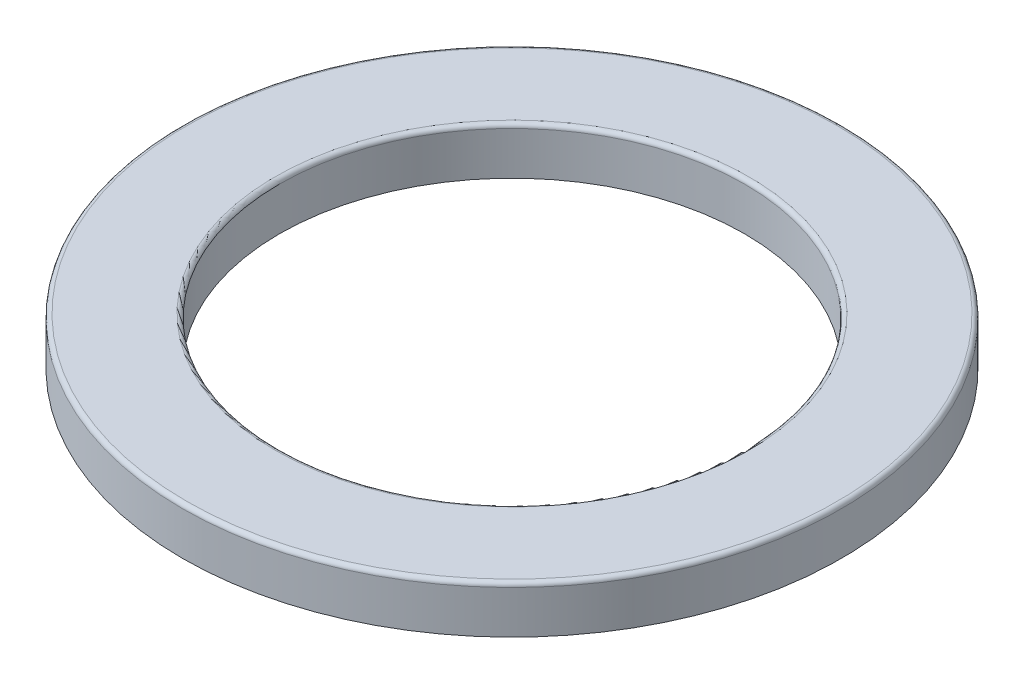
ISO-10303-21;
HEADER;
FILE_DESCRIPTION(('STEP AP214'),'2;1');
FILE_NAME('part.step','',(''),(''),'','','');
FILE_SCHEMA(('AUTOMOTIVE_DESIGN { 1 0 10303 214 1 1 1 1 }'));
ENDSEC;
DATA;
#1=APPLICATION_CONTEXT('core data for automotive mechanical design processes');
#2=APPLICATION_PROTOCOL_DEFINITION('international standard','automotive_design',2000,#1);
#3=PRODUCT_CONTEXT('',#1,'mechanical');
#4=PRODUCT('Part','Part','',(#3));
#5=PRODUCT_RELATED_PRODUCT_CATEGORY('part','',(#4));
#6=PRODUCT_DEFINITION_FORMATION('','',#4);
#7=PRODUCT_DEFINITION_CONTEXT('part definition',#1,'design');
#8=PRODUCT_DEFINITION('design','',#6,#7);
#9=PRODUCT_DEFINITION_SHAPE('','',#8);
#10=(LENGTH_UNIT() NAMED_UNIT(*) SI_UNIT(.MILLI.,.METRE.));
#11=(NAMED_UNIT(*) PLANE_ANGLE_UNIT() SI_UNIT($,.RADIAN.));
#12=(NAMED_UNIT(*) SI_UNIT($,.STERADIAN.) SOLID_ANGLE_UNIT());
#13=UNCERTAINTY_MEASURE_WITH_UNIT(LENGTH_MEASURE(1.E-05),#10,'distance_accuracy_value','');
#14=(GEOMETRIC_REPRESENTATION_CONTEXT(3) GLOBAL_UNCERTAINTY_ASSIGNED_CONTEXT((#13)) GLOBAL_UNIT_ASSIGNED_CONTEXT((#10,
#11,#12)) REPRESENTATION_CONTEXT('',''));
#15=CARTESIAN_POINT('',(0.,0.,0.));
#16=DIRECTION('',(0.,0.,1.));
#17=DIRECTION('',(1.,0.,0.));
#18=AXIS2_PLACEMENT_3D('',#15,#16,#17);
#19=CARTESIAN_POINT('',(0.,0.,0.));
#20=DIRECTION('',(0.,1.,0.));
#21=DIRECTION('',(0.,0.,1.));
#22=AXIS2_PLACEMENT_3D('',#19,#20,#21);
#23=PLANE('',#22);
#24=CARTESIAN_POINT('',(0.,0.,0.));
#25=DIRECTION('',(0.,1.,0.));
#26=DIRECTION('',(0.,0.,1.));
#27=AXIS2_PLACEMENT_3D('',#24,#25,#26);
#28=CIRCLE('',#27,85.);
#29=CARTESIAN_POINT('',(0.,0.,85.));
#30=VERTEX_POINT('',#29);
#31=EDGE_CURVE('E52',#30,#30,#28,.T.);
#32=ORIENTED_EDGE('',*,*,#31,.F.);
#33=EDGE_LOOP('',(#32));
#34=FACE_BOUND('',#33,.T.);
#35=CARTESIAN_POINT('',(0.,0.,0.));
#36=DIRECTION('',(0.,1.,0.));
#37=DIRECTION('',(0.,0.,1.));
#38=AXIS2_PLACEMENT_3D('',#35,#36,#37);
#39=CIRCLE('',#38,77.98);
#40=CARTESIAN_POINT('',(0.,0.,77.98));
#41=VERTEX_POINT('',#40);
#42=EDGE_CURVE('E61',#41,#41,#39,.T.);
#43=ORIENTED_EDGE('',*,*,#42,.T.);
#44=EDGE_LOOP('',(#43));
#45=FACE_BOUND('',#44,.T.);
#46=ADVANCED_FACE('F32',(#34,#45),#23,.F.);
#47=CARTESIAN_POINT('',(0.,0.,0.));
#48=DIRECTION('',(0.,1.,0.));
#49=DIRECTION('',(0.,0.,1.));
#50=AXIS2_PLACEMENT_3D('',#47,#48,#49);
#51=CIRCLE('',#50,60.);
#52=CARTESIAN_POINT('',(0.,0.,60.));
#53=VERTEX_POINT('',#52);
#54=EDGE_CURVE('E55',#53,#53,#51,.T.);
#55=ORIENTED_EDGE('',*,*,#54,.T.);
#56=EDGE_LOOP('',(#55));
#57=FACE_BOUND('',#56,.T.);
#58=CARTESIAN_POINT('',(0.,0.,0.));
#59=DIRECTION('',(0.,1.,0.));
#60=DIRECTION('',(0.,0.,1.));
#61=AXIS2_PLACEMENT_3D('',#58,#59,#60);
#62=CIRCLE('',#61,67.02);
#63=CARTESIAN_POINT('',(0.,0.,67.02));
#64=VERTEX_POINT('',#63);
#65=EDGE_CURVE('E58',#64,#64,#62,.T.);
#66=ORIENTED_EDGE('',*,*,#65,.F.);
#67=EDGE_LOOP('',(#66));
#68=FACE_BOUND('',#67,.T.);
#69=ADVANCED_FACE('F72',(#57,#68),#23,.F.);
#70=CARTESIAN_POINT('',(0.,12.2,0.));
#71=DIRECTION('',(0.,1.,0.));
#72=DIRECTION('',(0.,0.,1.));
#73=AXIS2_PLACEMENT_3D('',#70,#71,#72);
#74=PLANE('',#73);
#75=CARTESIAN_POINT('',(0.,12.2,0.));
#76=DIRECTION('',(0.,1.,0.));
#77=DIRECTION('',(0.,0.,1.));
#78=AXIS2_PLACEMENT_3D('',#75,#76,#77);
#79=CIRCLE('',#78,61.1);
#80=CARTESIAN_POINT('',(0.,12.2,61.1));
#81=VERTEX_POINT('',#80);
#82=EDGE_CURVE('E39',#81,#81,#79,.F.);
#83=ORIENTED_EDGE('',*,*,#82,.T.);
#84=EDGE_LOOP('',(#83));
#85=FACE_BOUND('',#84,.T.);
#86=CARTESIAN_POINT('',(0.,12.2,0.));
#87=DIRECTION('',(0.,1.,0.));
#88=DIRECTION('',(0.,0.,1.));
#89=AXIS2_PLACEMENT_3D('',#86,#87,#88);
#90=CIRCLE('',#89,83.9);
#91=CARTESIAN_POINT('',(0.,12.2,83.9));
#92=VERTEX_POINT('',#91);
#93=EDGE_CURVE('E43',#92,#92,#90,.T.);
#94=ORIENTED_EDGE('',*,*,#93,.T.);
#95=EDGE_LOOP('',(#94));
#96=FACE_BOUND('',#95,.T.);
#97=ADVANCED_FACE('F74',(#85,#96),#74,.T.);
#98=CARTESIAN_POINT('',(0.,12.2,0.));
#99=DIRECTION('',(0.,-1.,0.));
#100=DIRECTION('',(0.,0.,-1.));
#101=AXIS2_PLACEMENT_3D('',#98,#99,#100);
#102=CYLINDRICAL_SURFACE('',#101,85.);
#103=CARTESIAN_POINT('',(0.,11.1,0.));
#104=DIRECTION('',(0.,1.,0.));
#105=DIRECTION('',(0.,0.,1.));
#106=AXIS2_PLACEMENT_3D('',#103,#104,#105);
#107=CIRCLE('',#106,85.);
#108=CARTESIAN_POINT('',(0.,11.1,85.));
#109=VERTEX_POINT('',#108);
#110=EDGE_CURVE('E10',#109,#109,#107,.F.);
#111=ORIENTED_EDGE('',*,*,#110,.T.);
#112=EDGE_LOOP('',(#111));
#113=FACE_BOUND('',#112,.T.);
#114=ORIENTED_EDGE('',*,*,#31,.T.);
#115=EDGE_LOOP('',(#114));
#116=FACE_BOUND('',#115,.T.);
#117=ADVANCED_FACE('F81',(#113,#116),#102,.T.);
#118=CARTESIAN_POINT('',(0.,12.2,0.));
#119=DIRECTION('',(0.,-1.,0.));
#120=DIRECTION('',(0.,0.,-1.));
#121=AXIS2_PLACEMENT_3D('',#118,#119,#120);
#122=CYLINDRICAL_SURFACE('',#121,60.);
#123=CARTESIAN_POINT('',(0.,11.1,0.));
#124=DIRECTION('',(0.,1.,0.));
#125=DIRECTION('',(0.,0.,1.));
#126=AXIS2_PLACEMENT_3D('',#123,#124,#125);
#127=CIRCLE('',#126,60.);
#128=CARTESIAN_POINT('',(0.,11.1,60.));
#129=VERTEX_POINT('',#128);
#130=EDGE_CURVE('E47',#129,#129,#127,.T.);
#131=ORIENTED_EDGE('',*,*,#130,.T.);
#132=EDGE_LOOP('',(#131));
#133=FACE_BOUND('',#132,.T.);
#134=ORIENTED_EDGE('',*,*,#54,.F.);
#135=EDGE_LOOP('',(#134));
#136=FACE_BOUND('',#135,.T.);
#137=ADVANCED_FACE('F87',(#133,#136),#122,.F.);
#138=CARTESIAN_POINT('',(0.,11.1,0.));
#139=DIRECTION('',(0.,1.,0.));
#140=DIRECTION('',(0.,0.,1.));
#141=AXIS2_PLACEMENT_3D('',#138,#139,#140);
#142=TOROIDAL_SURFACE('',#141,61.1,1.1);
#143=ORIENTED_EDGE('',*,*,#82,.F.);
#144=EDGE_LOOP('',(#143));
#145=FACE_BOUND('',#144,.T.);
#146=ORIENTED_EDGE('',*,*,#130,.F.);
#147=EDGE_LOOP('',(#146));
#148=FACE_BOUND('',#147,.T.);
#149=ADVANCED_FACE('F88',(#145,#148),#142,.T.);
#150=CARTESIAN_POINT('',(0.,11.1,0.));
#151=DIRECTION('',(0.,1.,0.));
#152=DIRECTION('',(0.,0.,1.));
#153=AXIS2_PLACEMENT_3D('',#150,#151,#152);
#154=TOROIDAL_SURFACE('',#153,83.9,1.1);
#155=ORIENTED_EDGE('',*,*,#110,.F.);
#156=EDGE_LOOP('',(#155));
#157=FACE_BOUND('',#156,.T.);
#158=ORIENTED_EDGE('',*,*,#93,.F.);
#159=EDGE_LOOP('',(#158));
#160=FACE_BOUND('',#159,.T.);
#161=ADVANCED_FACE('F34',(#157,#160),#154,.T.);
#162=CARTESIAN_POINT('',(0.,-7.30249957206435,0.));
#163=DIRECTION('',(0.,1.,0.));
#164=DIRECTION('',(0.,0.,1.));
#165=AXIS2_PLACEMENT_3D('',#162,#163,#164);
#166=TOROIDAL_SURFACE('',#165,72.5,9.13);
#167=ORIENTED_EDGE('',*,*,#42,.F.);
#168=EDGE_LOOP('',(#167));
#169=FACE_BOUND('',#168,.T.);
#170=ORIENTED_EDGE('',*,*,#65,.T.);
#171=EDGE_LOOP('',(#170));
#172=FACE_BOUND('',#171,.T.);
#173=ADVANCED_FACE('F66',(#169,#172),#166,.F.);
#174=CLOSED_SHELL('',(#46,#69,#97,#117,#137,#149,#161,#173));
#175=MANIFOLD_SOLID_BREP('B2',#174);
#176=ADVANCED_BREP_SHAPE_REPRESENTATION('',(#18,#175),#14);
#177=SHAPE_DEFINITION_REPRESENTATION(#9,#176);
ENDSEC;
END-ISO-10303-21;
